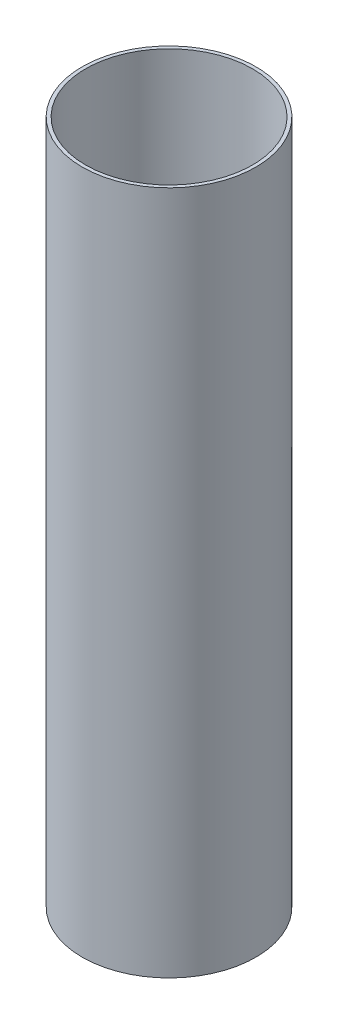
ISO-10303-21;
HEADER;
FILE_DESCRIPTION(('STEP AP214'),'2;1');
FILE_NAME('part.step','',(''),(''),'','','');
FILE_SCHEMA(('AUTOMOTIVE_DESIGN { 1 0 10303 214 1 1 1 1 }'));
ENDSEC;
DATA;
#1=APPLICATION_CONTEXT('core data for automotive mechanical design processes');
#2=APPLICATION_PROTOCOL_DEFINITION('international standard','automotive_design',2000,#1);
#3=PRODUCT_CONTEXT('',#1,'mechanical');
#4=PRODUCT('Part','Part','',(#3));
#5=PRODUCT_RELATED_PRODUCT_CATEGORY('part','',(#4));
#6=PRODUCT_DEFINITION_FORMATION('','',#4);
#7=PRODUCT_DEFINITION_CONTEXT('part definition',#1,'design');
#8=PRODUCT_DEFINITION('design','',#6,#7);
#9=PRODUCT_DEFINITION_SHAPE('','',#8);
#10=(LENGTH_UNIT() NAMED_UNIT(*) SI_UNIT(.MILLI.,.METRE.));
#11=(NAMED_UNIT(*) PLANE_ANGLE_UNIT() SI_UNIT($,.RADIAN.));
#12=(NAMED_UNIT(*) SI_UNIT($,.STERADIAN.) SOLID_ANGLE_UNIT());
#13=UNCERTAINTY_MEASURE_WITH_UNIT(LENGTH_MEASURE(1.E-05),#10,'distance_accuracy_value','');
#14=(GEOMETRIC_REPRESENTATION_CONTEXT(3) GLOBAL_UNCERTAINTY_ASSIGNED_CONTEXT((#13)) GLOBAL_UNIT_ASSIGNED_CONTEXT((#10,
#11,#12)) REPRESENTATION_CONTEXT('',''));
#15=CARTESIAN_POINT('',(0.,0.,0.));
#16=DIRECTION('',(0.,0.,1.));
#17=DIRECTION('',(1.,0.,0.));
#18=AXIS2_PLACEMENT_3D('',#15,#16,#17);
#19=CARTESIAN_POINT('',(0.,156.21,0.));
#20=DIRECTION('',(0.,1.,0.));
#21=DIRECTION('',(0.,0.,1.));
#22=AXIS2_PLACEMENT_3D('',#19,#20,#21);
#23=PLANE('',#22);
#24=CARTESIAN_POINT('',(0.,156.21,0.));
#25=DIRECTION('',(0.,1.,0.));
#26=DIRECTION('',(0.,0.,1.));
#27=AXIS2_PLACEMENT_3D('',#24,#25,#26);
#28=CIRCLE('',#27,39.6748);
#29=CARTESIAN_POINT('',(0.,156.21,39.6748));
#30=VERTEX_POINT('',#29);
#31=EDGE_CURVE('E10',#30,#30,#28,.T.);
#32=ORIENTED_EDGE('',*,*,#31,.T.);
#33=EDGE_LOOP('',(#32));
#34=FACE_BOUND('',#33,.T.);
#35=CARTESIAN_POINT('',(0.,156.21,0.));
#36=DIRECTION('',(0.,1.,0.));
#37=DIRECTION('',(0.,0.,1.));
#38=AXIS2_PLACEMENT_3D('',#35,#36,#37);
#39=CIRCLE('',#38,38.1);
#40=CARTESIAN_POINT('',(0.,156.21,38.1));
#41=VERTEX_POINT('',#40);
#42=EDGE_CURVE('E47',#41,#41,#39,.T.);
#43=ORIENTED_EDGE('',*,*,#42,.F.);
#44=EDGE_LOOP('',(#43));
#45=FACE_BOUND('',#44,.T.);
#46=ADVANCED_FACE('F36',(#34,#45),#23,.T.);
#47=CARTESIAN_POINT('',(0.,-156.21,0.));
#48=DIRECTION('',(0.,1.,0.));
#49=DIRECTION('',(0.,0.,1.));
#50=AXIS2_PLACEMENT_3D('',#47,#48,#49);
#51=PLANE('',#50);
#52=CARTESIAN_POINT('',(0.,-156.21,0.));
#53=DIRECTION('',(0.,1.,0.));
#54=DIRECTION('',(0.,0.,1.));
#55=AXIS2_PLACEMENT_3D('',#52,#53,#54);
#56=CIRCLE('',#55,39.6748);
#57=CARTESIAN_POINT('',(0.,-156.21,39.6748));
#58=VERTEX_POINT('',#57);
#59=EDGE_CURVE('E40',#58,#58,#56,.T.);
#60=ORIENTED_EDGE('',*,*,#59,.F.);
#61=EDGE_LOOP('',(#60));
#62=FACE_BOUND('',#61,.T.);
#63=CARTESIAN_POINT('',(0.,-156.21,0.));
#64=DIRECTION('',(0.,1.,0.));
#65=DIRECTION('',(0.,0.,1.));
#66=AXIS2_PLACEMENT_3D('',#63,#64,#65);
#67=CIRCLE('',#66,38.1);
#68=CARTESIAN_POINT('',(0.,-156.21,38.1));
#69=VERTEX_POINT('',#68);
#70=EDGE_CURVE('E49',#69,#69,#67,.T.);
#71=ORIENTED_EDGE('',*,*,#70,.T.);
#72=EDGE_LOOP('',(#71));
#73=FACE_BOUND('',#72,.T.);
#74=ADVANCED_FACE('F59',(#62,#73),#51,.F.);
#75=CARTESIAN_POINT('',(0.,156.21,0.));
#76=DIRECTION('',(0.,-1.,0.));
#77=DIRECTION('',(0.,0.,-1.));
#78=AXIS2_PLACEMENT_3D('',#75,#76,#77);
#79=CYLINDRICAL_SURFACE('',#78,39.6748);
#80=ORIENTED_EDGE('',*,*,#31,.F.);
#81=EDGE_LOOP('',(#80));
#82=FACE_BOUND('',#81,.T.);
#83=ORIENTED_EDGE('',*,*,#59,.T.);
#84=EDGE_LOOP('',(#83));
#85=FACE_BOUND('',#84,.T.);
#86=ADVANCED_FACE('F38',(#82,#85),#79,.T.);
#87=CARTESIAN_POINT('',(0.,156.21,0.));
#88=DIRECTION('',(0.,-1.,0.));
#89=DIRECTION('',(0.,0.,-1.));
#90=AXIS2_PLACEMENT_3D('',#87,#88,#89);
#91=CYLINDRICAL_SURFACE('',#90,38.1);
#92=ORIENTED_EDGE('',*,*,#42,.T.);
#93=EDGE_LOOP('',(#92));
#94=FACE_BOUND('',#93,.T.);
#95=ORIENTED_EDGE('',*,*,#70,.F.);
#96=EDGE_LOOP('',(#95));
#97=FACE_BOUND('',#96,.T.);
#98=ADVANCED_FACE('F55',(#94,#97),#91,.F.);
#99=CLOSED_SHELL('',(#46,#74,#86,#98));
#100=MANIFOLD_SOLID_BREP('B2',#99);
#101=ADVANCED_BREP_SHAPE_REPRESENTATION('',(#18,#100),#14);
#102=SHAPE_DEFINITION_REPRESENTATION(#9,#101);
ENDSEC;
END-ISO-10303-21;
